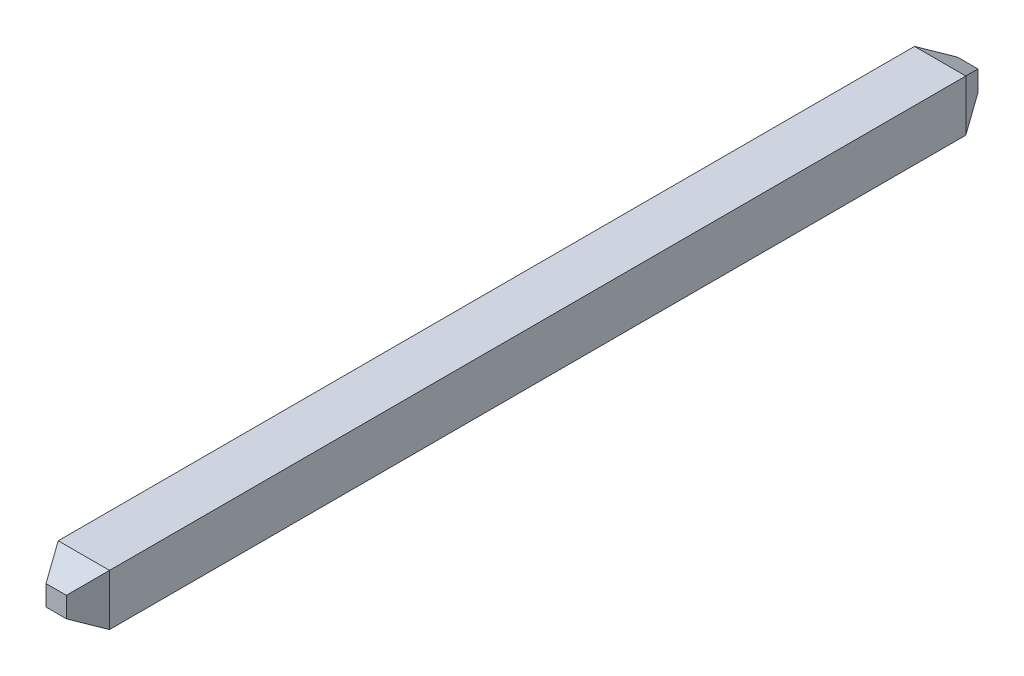
ISO-10303-21;
HEADER;
FILE_DESCRIPTION(('STEP AP214'),'2;1');
FILE_NAME('part.step','',(''),(''),'','','');
FILE_SCHEMA(('AUTOMOTIVE_DESIGN { 1 0 10303 214 1 1 1 1 }'));
ENDSEC;
DATA;
#1=APPLICATION_CONTEXT('core data for automotive mechanical design processes');
#2=APPLICATION_PROTOCOL_DEFINITION('international standard','automotive_design',2000,#1);
#3=PRODUCT_CONTEXT('',#1,'mechanical');
#4=PRODUCT('Part','Part','',(#3));
#5=PRODUCT_RELATED_PRODUCT_CATEGORY('part','',(#4));
#6=PRODUCT_DEFINITION_FORMATION('','',#4);
#7=PRODUCT_DEFINITION_CONTEXT('part definition',#1,'design');
#8=PRODUCT_DEFINITION('design','',#6,#7);
#9=PRODUCT_DEFINITION_SHAPE('','',#8);
#10=(LENGTH_UNIT() NAMED_UNIT(*) SI_UNIT(.MILLI.,.METRE.));
#11=(NAMED_UNIT(*) PLANE_ANGLE_UNIT() SI_UNIT($,.RADIAN.));
#12=(NAMED_UNIT(*) SI_UNIT($,.STERADIAN.) SOLID_ANGLE_UNIT());
#13=UNCERTAINTY_MEASURE_WITH_UNIT(LENGTH_MEASURE(1.E-05),#10,'distance_accuracy_value','');
#14=(GEOMETRIC_REPRESENTATION_CONTEXT(3) GLOBAL_UNCERTAINTY_ASSIGNED_CONTEXT((#13)) GLOBAL_UNIT_ASSIGNED_CONTEXT((#10,
#11,#12)) REPRESENTATION_CONTEXT('',''));
#15=CARTESIAN_POINT('',(0.,0.,0.));
#16=DIRECTION('',(0.,0.,1.));
#17=DIRECTION('',(1.,0.,0.));
#18=AXIS2_PLACEMENT_3D('',#15,#16,#17);
#19=CARTESIAN_POINT('',(0.,0.315,-5.26000017185899));
#20=DIRECTION('',(0.,0.872943377132661,-0.48782154556787));
#21=DIRECTION('',(0.,0.48782154556787,0.872943377132661));
#22=AXIS2_PLACEMENT_3D('',#19,#20,#21);
#23=PLANE('',#22);
#24=DIRECTION('',(-0.438435732711342,0.438435732711339,0.784568809323784));
#25=VECTOR('',#24,1.);
#26=CARTESIAN_POINT('',(-0.1251070822627,0.124999999998453,-5.6));
#27=LINE('',#26,#25);
#28=CARTESIAN_POINT('',(-0.1251070822627,0.124999999998453,-5.6));
#29=VERTEX_POINT('',#28);
#30=CARTESIAN_POINT('',(-0.315107082264247,0.315,-5.26000017185899));
#31=VERTEX_POINT('',#30);
#32=EDGE_CURVE('E83',#29,#31,#27,.T.);
#33=ORIENTED_EDGE('',*,*,#32,.T.);
#34=DIRECTION('',(1.,0.,0.));
#35=VECTOR('',#34,1.);
#36=CARTESIAN_POINT('',(0.,0.315,-5.26000017185899));
#37=LINE('',#36,#35);
#38=CARTESIAN_POINT('',(0.315107082264248,0.315,-5.26000017185899));
#39=VERTEX_POINT('',#38);
#40=EDGE_CURVE('E107',#31,#39,#37,.T.);
#41=ORIENTED_EDGE('',*,*,#40,.T.);
#42=DIRECTION('',(-0.438435732711342,-0.438435732711339,-0.784568809323784));
#43=VECTOR('',#42,1.);
#44=CARTESIAN_POINT('',(0.315107082264248,0.315,-5.26000017185899));
#45=LINE('',#44,#43);
#46=CARTESIAN_POINT('',(0.1251070822627,0.124999999998453,-5.6));
#47=VERTEX_POINT('',#46);
#48=EDGE_CURVE('E86',#39,#47,#45,.T.);
#49=ORIENTED_EDGE('',*,*,#48,.T.);
#50=DIRECTION('',(-1.,0.,0.));
#51=VECTOR('',#50,1.);
#52=CARTESIAN_POINT('',(-0.315107082264247,0.124999999998453,-5.6));
#53=LINE('',#52,#51);
#54=EDGE_CURVE('E20',#29,#47,#53,.F.);
#55=ORIENTED_EDGE('',*,*,#54,.F.);
#56=EDGE_LOOP('',(#33,#41,#49,#55));
#57=FACE_BOUND('',#56,.T.);
#58=ADVANCED_FACE('F17',(#57),#23,.T.);
#59=CARTESIAN_POINT('',(0.,0.315,5.26000017185899));
#60=DIRECTION('',(0.,0.872943377132661,0.48782154556787));
#61=DIRECTION('',(0.,-0.48782154556787,0.872943377132661));
#62=AXIS2_PLACEMENT_3D('',#59,#60,#61);
#63=PLANE('',#62);
#64=DIRECTION('',(0.438435732711342,0.438435732711339,-0.784568809323784));
#65=VECTOR('',#64,1.);
#66=CARTESIAN_POINT('',(0.125107082262701,0.124999999998453,5.6));
#67=LINE('',#66,#65);
#68=CARTESIAN_POINT('',(0.125107082262701,0.124999999998453,5.6));
#69=VERTEX_POINT('',#68);
#70=CARTESIAN_POINT('',(0.315107082264248,0.315,5.26000017185899));
#71=VERTEX_POINT('',#70);
#72=EDGE_CURVE('E114',#69,#71,#67,.T.);
#73=ORIENTED_EDGE('',*,*,#72,.T.);
#74=DIRECTION('',(1.,0.,0.));
#75=VECTOR('',#74,1.);
#76=CARTESIAN_POINT('',(0.,0.315,5.26000017185899));
#77=LINE('',#76,#75);
#78=CARTESIAN_POINT('',(-0.315107082264247,0.315,5.26000017185899));
#79=VERTEX_POINT('',#78);
#80=EDGE_CURVE('E105',#71,#79,#77,.F.);
#81=ORIENTED_EDGE('',*,*,#80,.T.);
#82=DIRECTION('',(0.438435732711342,-0.438435732711339,0.784568809323784));
#83=VECTOR('',#82,1.);
#84=CARTESIAN_POINT('',(-0.315107082264247,0.315,5.26000017185899));
#85=LINE('',#84,#83);
#86=CARTESIAN_POINT('',(-0.1251070822627,0.124999999998453,5.6));
#87=VERTEX_POINT('',#86);
#88=EDGE_CURVE('E118',#79,#87,#85,.T.);
#89=ORIENTED_EDGE('',*,*,#88,.T.);
#90=DIRECTION('',(1.,0.,0.));
#91=VECTOR('',#90,1.);
#92=CARTESIAN_POINT('',(-0.315107082264247,0.124999999998453,5.6));
#93=LINE('',#92,#91);
#94=EDGE_CURVE('E109',#69,#87,#93,.F.);
#95=ORIENTED_EDGE('',*,*,#94,.F.);
#96=EDGE_LOOP('',(#73,#81,#89,#95));
#97=FACE_BOUND('',#96,.T.);
#98=ADVANCED_FACE('F184',(#97),#63,.T.);
#99=CARTESIAN_POINT('',(-0.315107082264247,-0.315,-5.6));
#100=DIRECTION('',(0.,0.,-1.));
#101=DIRECTION('',(-1.,0.,0.));
#102=AXIS2_PLACEMENT_3D('',#99,#100,#101);
#103=PLANE('',#102);
#104=ORIENTED_EDGE('',*,*,#54,.T.);
#105=DIRECTION('',(0.,1.,0.));
#106=VECTOR('',#105,1.);
#107=CARTESIAN_POINT('',(0.125107082262699,-0.315,-5.6));
#108=LINE('',#107,#106);
#109=CARTESIAN_POINT('',(0.1251070822627,-0.124999999998453,-5.6));
#110=VERTEX_POINT('',#109);
#111=EDGE_CURVE('E100',#47,#110,#108,.F.);
#112=ORIENTED_EDGE('',*,*,#111,.T.);
#113=DIRECTION('',(1.,0.,0.));
#114=VECTOR('',#113,1.);
#115=CARTESIAN_POINT('',(-0.315107082264247,-0.124999999998453,-5.6));
#116=LINE('',#115,#114);
#117=CARTESIAN_POINT('',(-0.1251070822627,-0.124999999998453,-5.6));
#118=VERTEX_POINT('',#117);
#119=EDGE_CURVE('E92',#110,#118,#116,.F.);
#120=ORIENTED_EDGE('',*,*,#119,.T.);
#121=DIRECTION('',(0.,1.,0.));
#122=VECTOR('',#121,1.);
#123=CARTESIAN_POINT('',(-0.1251070822627,-0.315,-5.6));
#124=LINE('',#123,#122);
#125=EDGE_CURVE('E88',#118,#29,#124,.T.);
#126=ORIENTED_EDGE('',*,*,#125,.T.);
#127=EDGE_LOOP('',(#104,#112,#120,#126));
#128=FACE_BOUND('',#127,.T.);
#129=ADVANCED_FACE('F90',(#128),#103,.T.);
#130=CARTESIAN_POINT('',(-0.1251070822627,-0.315,-5.6));
#131=DIRECTION('',(0.872943377132661,0.,0.48782154556787));
#132=DIRECTION('',(0.48782154556787,0.,-0.872943377132661));
#133=AXIS2_PLACEMENT_3D('',#130,#131,#132);
#134=PLANE('',#133);
#135=DIRECTION('',(0.,1.,0.));
#136=VECTOR('',#135,1.);
#137=CARTESIAN_POINT('',(-0.315107082264247,-0.315,-5.26000017185899));
#138=LINE('',#137,#136);
#139=CARTESIAN_POINT('',(-0.315107082264248,-0.315,-5.26000017185899));
#140=VERTEX_POINT('',#139);
#141=EDGE_CURVE('E98',#31,#140,#138,.F.);
#142=ORIENTED_EDGE('',*,*,#141,.F.);
#143=ORIENTED_EDGE('',*,*,#32,.F.);
#144=ORIENTED_EDGE('',*,*,#125,.F.);
#145=DIRECTION('',(-0.438435732711339,-0.438435732711342,0.784568809323784));
#146=VECTOR('',#145,1.);
#147=CARTESIAN_POINT('',(-0.1251070822627,-0.124999999998453,-5.6));
#148=LINE('',#147,#146);
#149=EDGE_CURVE('E128',#118,#140,#148,.T.);
#150=ORIENTED_EDGE('',*,*,#149,.T.);
#151=EDGE_LOOP('',(#142,#143,#144,#150));
#152=FACE_BOUND('',#151,.T.);
#153=ADVANCED_FACE('F96',(#152),#134,.F.);
#154=CARTESIAN_POINT('',(0.315107082264248,-0.315,-5.26000017185899));
#155=DIRECTION('',(-0.872943377132661,0.,0.48782154556787));
#156=DIRECTION('',(0.48782154556787,0.,0.872943377132661));
#157=AXIS2_PLACEMENT_3D('',#154,#155,#156);
#158=PLANE('',#157);
#159=DIRECTION('',(0.,1.,0.));
#160=VECTOR('',#159,1.);
#161=CARTESIAN_POINT('',(0.315107082264248,-0.315,-5.26000017185899));
#162=LINE('',#161,#160);
#163=CARTESIAN_POINT('',(0.315107082264248,-0.315,-5.26000017185899));
#164=VERTEX_POINT('',#163);
#165=EDGE_CURVE('E133',#164,#39,#162,.T.);
#166=ORIENTED_EDGE('',*,*,#165,.F.);
#167=DIRECTION('',(-0.43843573271134,0.438435732711342,-0.784568809323783));
#168=VECTOR('',#167,1.);
#169=CARTESIAN_POINT('',(0.315107082264248,-0.315000000000002,-5.26000017185899));
#170=LINE('',#169,#168);
#171=EDGE_CURVE('E130',#164,#110,#170,.T.);
#172=ORIENTED_EDGE('',*,*,#171,.T.);
#173=ORIENTED_EDGE('',*,*,#111,.F.);
#174=ORIENTED_EDGE('',*,*,#48,.F.);
#175=EDGE_LOOP('',(#166,#172,#173,#174));
#176=FACE_BOUND('',#175,.T.);
#177=ADVANCED_FACE('F179',(#176),#158,.F.);
#178=CARTESIAN_POINT('',(0.,0.315,0.));
#179=DIRECTION('',(0.,-1.,0.));
#180=DIRECTION('',(0.,0.,-1.));
#181=AXIS2_PLACEMENT_3D('',#178,#179,#180);
#182=PLANE('',#181);
#183=ORIENTED_EDGE('',*,*,#40,.F.);
#184=DIRECTION('',(0.,0.,1.));
#185=VECTOR('',#184,1.);
#186=CARTESIAN_POINT('',(-0.315107082264247,0.315,5.6));
#187=LINE('',#186,#185);
#188=EDGE_CURVE('E121',#79,#31,#187,.F.);
#189=ORIENTED_EDGE('',*,*,#188,.F.);
#190=ORIENTED_EDGE('',*,*,#80,.F.);
#191=DIRECTION('',(0.,0.,-1.));
#192=VECTOR('',#191,1.);
#193=CARTESIAN_POINT('',(0.315107082264248,0.315,5.6));
#194=LINE('',#193,#192);
#195=EDGE_CURVE('E136',#39,#71,#194,.F.);
#196=ORIENTED_EDGE('',*,*,#195,.F.);
#197=EDGE_LOOP('',(#183,#189,#190,#196));
#198=FACE_BOUND('',#197,.T.);
#199=ADVANCED_FACE('F182',(#198),#182,.F.);
#200=CARTESIAN_POINT('',(-0.315107082264247,-0.315,5.6));
#201=DIRECTION('',(0.,0.,1.));
#202=DIRECTION('',(1.,0.,0.));
#203=AXIS2_PLACEMENT_3D('',#200,#201,#202);
#204=PLANE('',#203);
#205=ORIENTED_EDGE('',*,*,#94,.T.);
#206=DIRECTION('',(0.,1.,0.));
#207=VECTOR('',#206,1.);
#208=CARTESIAN_POINT('',(-0.125107082262698,-0.315,5.6));
#209=LINE('',#208,#207);
#210=CARTESIAN_POINT('',(-0.1251070822627,-0.124999999998453,5.6));
#211=VERTEX_POINT('',#210);
#212=EDGE_CURVE('E116',#87,#211,#209,.F.);
#213=ORIENTED_EDGE('',*,*,#212,.T.);
#214=DIRECTION('',(1.,0.,0.));
#215=VECTOR('',#214,1.);
#216=CARTESIAN_POINT('',(-0.315107082264247,-0.124999999998453,5.6));
#217=LINE('',#216,#215);
#218=CARTESIAN_POINT('',(0.125107082262701,-0.124999999998453,5.6));
#219=VERTEX_POINT('',#218);
#220=EDGE_CURVE('E141',#211,#219,#217,.T.);
#221=ORIENTED_EDGE('',*,*,#220,.T.);
#222=DIRECTION('',(0.,1.,0.));
#223=VECTOR('',#222,1.);
#224=CARTESIAN_POINT('',(0.125107082262701,-0.315,5.6));
#225=LINE('',#224,#223);
#226=EDGE_CURVE('E111',#219,#69,#225,.T.);
#227=ORIENTED_EDGE('',*,*,#226,.T.);
#228=EDGE_LOOP('',(#205,#213,#221,#227));
#229=FACE_BOUND('',#228,.T.);
#230=ADVANCED_FACE('F187',(#229),#204,.T.);
#231=CARTESIAN_POINT('',(0.125107082262701,-0.315,5.6));
#232=DIRECTION('',(-0.872943377132661,0.,-0.48782154556787));
#233=DIRECTION('',(-0.48782154556787,0.,0.872943377132661));
#234=AXIS2_PLACEMENT_3D('',#231,#232,#233);
#235=PLANE('',#234);
#236=DIRECTION('',(0.,1.,0.));
#237=VECTOR('',#236,1.);
#238=CARTESIAN_POINT('',(0.315107082264248,-0.315,5.26000017185899));
#239=LINE('',#238,#237);
#240=CARTESIAN_POINT('',(0.315107082264249,-0.315,5.26000017185899));
#241=VERTEX_POINT('',#240);
#242=EDGE_CURVE('E139',#71,#241,#239,.F.);
#243=ORIENTED_EDGE('',*,*,#242,.F.);
#244=ORIENTED_EDGE('',*,*,#72,.F.);
#245=ORIENTED_EDGE('',*,*,#226,.F.);
#246=DIRECTION('',(0.438435732711339,-0.438435732711342,-0.784568809323784));
#247=VECTOR('',#246,1.);
#248=CARTESIAN_POINT('',(0.125107082262701,-0.124999999998453,5.6));
#249=LINE('',#248,#247);
#250=EDGE_CURVE('E35',#219,#241,#249,.T.);
#251=ORIENTED_EDGE('',*,*,#250,.T.);
#252=EDGE_LOOP('',(#243,#244,#245,#251));
#253=FACE_BOUND('',#252,.T.);
#254=ADVANCED_FACE('F185',(#253),#235,.F.);
#255=CARTESIAN_POINT('',(-0.315107082264247,-0.315,5.26000017185899));
#256=DIRECTION('',(0.872943377132661,0.,-0.48782154556787));
#257=DIRECTION('',(-0.48782154556787,0.,-0.872943377132661));
#258=AXIS2_PLACEMENT_3D('',#255,#256,#257);
#259=PLANE('',#258);
#260=DIRECTION('',(0.,1.,0.));
#261=VECTOR('',#260,1.);
#262=CARTESIAN_POINT('',(-0.315107082264247,-0.315,5.26000017185899));
#263=LINE('',#262,#261);
#264=CARTESIAN_POINT('',(-0.315107082264247,-0.315,5.26000017185899));
#265=VERTEX_POINT('',#264);
#266=EDGE_CURVE('E124',#265,#79,#263,.T.);
#267=ORIENTED_EDGE('',*,*,#266,.F.);
#268=DIRECTION('',(0.438435732711337,0.438435732711343,0.784568809323785));
#269=VECTOR('',#268,1.);
#270=CARTESIAN_POINT('',(-0.315107082264247,-0.315000000000002,5.26000017185899));
#271=LINE('',#270,#269);
#272=EDGE_CURVE('E144',#265,#211,#271,.T.);
#273=ORIENTED_EDGE('',*,*,#272,.T.);
#274=ORIENTED_EDGE('',*,*,#212,.F.);
#275=ORIENTED_EDGE('',*,*,#88,.F.);
#276=EDGE_LOOP('',(#267,#273,#274,#275));
#277=FACE_BOUND('',#276,.T.);
#278=ADVANCED_FACE('F169',(#277),#259,.F.);
#279=CARTESIAN_POINT('',(-0.315107082264247,-0.315,5.6));
#280=DIRECTION('',(-1.,0.,0.));
#281=DIRECTION('',(0.,0.,1.));
#282=AXIS2_PLACEMENT_3D('',#279,#280,#281);
#283=PLANE('',#282);
#284=DIRECTION('',(0.,0.,-1.));
#285=VECTOR('',#284,1.);
#286=CARTESIAN_POINT('',(-0.315107082264247,-0.315,0.));
#287=LINE('',#286,#285);
#288=EDGE_CURVE('E147',#265,#140,#287,.T.);
#289=ORIENTED_EDGE('',*,*,#288,.F.);
#290=ORIENTED_EDGE('',*,*,#266,.T.);
#291=ORIENTED_EDGE('',*,*,#188,.T.);
#292=ORIENTED_EDGE('',*,*,#141,.T.);
#293=EDGE_LOOP('',(#289,#290,#291,#292));
#294=FACE_BOUND('',#293,.T.);
#295=ADVANCED_FACE('F173',(#294),#283,.T.);
#296=CARTESIAN_POINT('',(-0.315107082264247,-0.124999999998453,-5.6));
#297=DIRECTION('',(0.,0.872943377132661,0.48782154556787));
#298=DIRECTION('',(0.,-0.48782154556787,0.872943377132661));
#299=AXIS2_PLACEMENT_3D('',#296,#297,#298);
#300=PLANE('',#299);
#301=DIRECTION('',(1.,0.,0.));
#302=VECTOR('',#301,1.);
#303=CARTESIAN_POINT('',(0.,-0.315,-5.26000017185899));
#304=LINE('',#303,#302);
#305=EDGE_CURVE('E150',#140,#164,#304,.T.);
#306=ORIENTED_EDGE('',*,*,#305,.F.);
#307=ORIENTED_EDGE('',*,*,#149,.F.);
#308=ORIENTED_EDGE('',*,*,#119,.F.);
#309=ORIENTED_EDGE('',*,*,#171,.F.);
#310=EDGE_LOOP('',(#306,#307,#308,#309));
#311=FACE_BOUND('',#310,.T.);
#312=ADVANCED_FACE('F177',(#311),#300,.F.);
#313=CARTESIAN_POINT('',(0.315107082264248,-0.315,5.6));
#314=DIRECTION('',(1.,0.,0.));
#315=DIRECTION('',(0.,0.,-1.));
#316=AXIS2_PLACEMENT_3D('',#313,#314,#315);
#317=PLANE('',#316);
#318=ORIENTED_EDGE('',*,*,#195,.T.);
#319=ORIENTED_EDGE('',*,*,#242,.T.);
#320=DIRECTION('',(0.,0.,-1.));
#321=VECTOR('',#320,1.);
#322=CARTESIAN_POINT('',(0.315107082264248,-0.315,0.));
#323=LINE('',#322,#321);
#324=EDGE_CURVE('E26',#164,#241,#323,.F.);
#325=ORIENTED_EDGE('',*,*,#324,.F.);
#326=ORIENTED_EDGE('',*,*,#165,.T.);
#327=EDGE_LOOP('',(#318,#319,#325,#326));
#328=FACE_BOUND('',#327,.T.);
#329=ADVANCED_FACE('F160',(#328),#317,.T.);
#330=CARTESIAN_POINT('',(-0.315107082264247,-0.124999999998453,5.6));
#331=DIRECTION('',(0.,0.872943377132661,-0.48782154556787));
#332=DIRECTION('',(0.,0.48782154556787,0.872943377132661));
#333=AXIS2_PLACEMENT_3D('',#330,#331,#332);
#334=PLANE('',#333);
#335=DIRECTION('',(1.,0.,0.));
#336=VECTOR('',#335,1.);
#337=CARTESIAN_POINT('',(0.,-0.315,5.26000017185899));
#338=LINE('',#337,#336);
#339=EDGE_CURVE('E11',#241,#265,#338,.F.);
#340=ORIENTED_EDGE('',*,*,#339,.F.);
#341=ORIENTED_EDGE('',*,*,#250,.F.);
#342=ORIENTED_EDGE('',*,*,#220,.F.);
#343=ORIENTED_EDGE('',*,*,#272,.F.);
#344=EDGE_LOOP('',(#340,#341,#342,#343));
#345=FACE_BOUND('',#344,.T.);
#346=ADVANCED_FACE('F165',(#345),#334,.F.);
#347=CARTESIAN_POINT('',(0.,-0.315,0.));
#348=DIRECTION('',(0.,-1.,0.));
#349=DIRECTION('',(0.,0.,-1.));
#350=AXIS2_PLACEMENT_3D('',#347,#348,#349);
#351=PLANE('',#350);
#352=ORIENTED_EDGE('',*,*,#324,.T.);
#353=ORIENTED_EDGE('',*,*,#339,.T.);
#354=ORIENTED_EDGE('',*,*,#288,.T.);
#355=ORIENTED_EDGE('',*,*,#305,.T.);
#356=EDGE_LOOP('',(#352,#353,#354,#355));
#357=FACE_BOUND('',#356,.T.);
#358=ADVANCED_FACE('F156',(#357),#351,.T.);
#359=CLOSED_SHELL('',(#58,#98,#129,#153,#177,#199,#230,#254,#278,#295,#312,#329,#346,#358));
#360=MANIFOLD_SOLID_BREP('B1',#359);
#361=ADVANCED_BREP_SHAPE_REPRESENTATION('',(#18,#360),#14);
#362=SHAPE_DEFINITION_REPRESENTATION(#9,#361);
ENDSEC;
END-ISO-10303-21;
